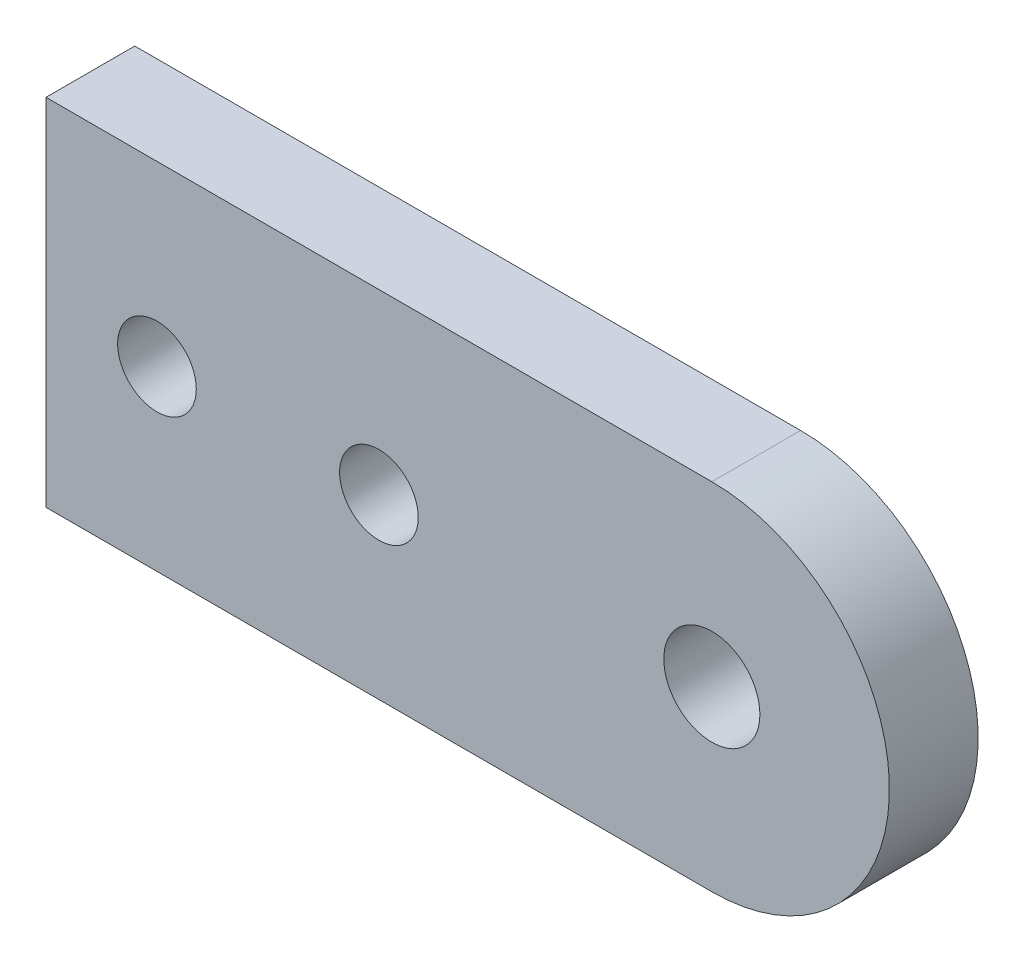
ISO-10303-21;
HEADER;
FILE_DESCRIPTION(('STEP AP214'),'2;1');
FILE_NAME('part.step','',(''),(''),'','','');
FILE_SCHEMA(('AUTOMOTIVE_DESIGN { 1 0 10303 214 1 1 1 1 }'));
ENDSEC;
DATA;
#1=APPLICATION_CONTEXT('core data for automotive mechanical design processes');
#2=APPLICATION_PROTOCOL_DEFINITION('international standard','automotive_design',2000,#1);
#3=PRODUCT_CONTEXT('',#1,'mechanical');
#4=PRODUCT('Part','Part','',(#3));
#5=PRODUCT_RELATED_PRODUCT_CATEGORY('part','',(#4));
#6=PRODUCT_DEFINITION_FORMATION('','',#4);
#7=PRODUCT_DEFINITION_CONTEXT('part definition',#1,'design');
#8=PRODUCT_DEFINITION('design','',#6,#7);
#9=PRODUCT_DEFINITION_SHAPE('','',#8);
#10=(LENGTH_UNIT() NAMED_UNIT(*) SI_UNIT(.MILLI.,.METRE.));
#11=(NAMED_UNIT(*) PLANE_ANGLE_UNIT() SI_UNIT($,.RADIAN.));
#12=(NAMED_UNIT(*) SI_UNIT($,.STERADIAN.) SOLID_ANGLE_UNIT());
#13=UNCERTAINTY_MEASURE_WITH_UNIT(LENGTH_MEASURE(1.E-05),#10,'distance_accuracy_value','');
#14=(GEOMETRIC_REPRESENTATION_CONTEXT(3) GLOBAL_UNCERTAINTY_ASSIGNED_CONTEXT((#13)) GLOBAL_UNIT_ASSIGNED_CONTEXT((#10,
#11,#12)) REPRESENTATION_CONTEXT('',''));
#15=CARTESIAN_POINT('',(0.,0.,0.));
#16=DIRECTION('',(0.,0.,1.));
#17=DIRECTION('',(1.,0.,0.));
#18=AXIS2_PLACEMENT_3D('',#15,#16,#17);
#19=CARTESIAN_POINT('',(38.1,10.16,5.08));
#20=DIRECTION('',(0.,-1.,0.));
#21=DIRECTION('',(1.,0.,0.));
#22=AXIS2_PLACEMENT_3D('',#19,#20,#21);
#23=PLANE('',#22);
#24=DIRECTION('',(-1.,0.,0.));
#25=VECTOR('',#24,1.);
#26=CARTESIAN_POINT('',(38.1,10.16,0.));
#27=LINE('',#26,#25);
#28=CARTESIAN_POINT('',(38.1,10.16,0.));
#29=VERTEX_POINT('',#28);
#30=CARTESIAN_POINT('',(0.,10.16,0.));
#31=VERTEX_POINT('',#30);
#32=EDGE_CURVE('E107',#29,#31,#27,.T.);
#33=ORIENTED_EDGE('',*,*,#32,.T.);
#34=DIRECTION('',(0.,0.,-1.));
#35=VECTOR('',#34,1.);
#36=CARTESIAN_POINT('',(0.,10.16,5.08));
#37=LINE('',#36,#35);
#38=CARTESIAN_POINT('',(0.,10.16,5.08));
#39=VERTEX_POINT('',#38);
#40=EDGE_CURVE('E11',#39,#31,#37,.T.);
#41=ORIENTED_EDGE('',*,*,#40,.F.);
#42=DIRECTION('',(-1.,0.,0.));
#43=VECTOR('',#42,1.);
#44=CARTESIAN_POINT('',(38.1,10.16,5.08));
#45=LINE('',#44,#43);
#46=CARTESIAN_POINT('',(38.1,10.16,5.08));
#47=VERTEX_POINT('',#46);
#48=EDGE_CURVE('E91',#47,#39,#45,.T.);
#49=ORIENTED_EDGE('',*,*,#48,.F.);
#50=DIRECTION('',(0.,0.,-1.));
#51=VECTOR('',#50,1.);
#52=CARTESIAN_POINT('',(38.1,10.16,5.08));
#53=LINE('',#52,#51);
#54=EDGE_CURVE('E103',#47,#29,#53,.T.);
#55=ORIENTED_EDGE('',*,*,#54,.T.);
#56=EDGE_LOOP('',(#33,#41,#49,#55));
#57=FACE_BOUND('',#56,.T.);
#58=ADVANCED_FACE('F39',(#57),#23,.F.);
#59=CARTESIAN_POINT('',(0.,10.16,5.08));
#60=DIRECTION('',(1.,0.,0.));
#61=DIRECTION('',(0.,1.,0.));
#62=AXIS2_PLACEMENT_3D('',#59,#60,#61);
#63=PLANE('',#62);
#64=DIRECTION('',(0.,-1.,0.));
#65=VECTOR('',#64,1.);
#66=CARTESIAN_POINT('',(0.,10.16,0.));
#67=LINE('',#66,#65);
#68=CARTESIAN_POINT('',(0.,-10.16,0.));
#69=VERTEX_POINT('',#68);
#70=EDGE_CURVE('E96',#31,#69,#67,.T.);
#71=ORIENTED_EDGE('',*,*,#70,.T.);
#72=DIRECTION('',(0.,0.,-1.));
#73=VECTOR('',#72,1.);
#74=CARTESIAN_POINT('',(0.,-10.16,5.08));
#75=LINE('',#74,#73);
#76=CARTESIAN_POINT('',(0.,-10.16,5.08));
#77=VERTEX_POINT('',#76);
#78=EDGE_CURVE('E48',#77,#69,#75,.T.);
#79=ORIENTED_EDGE('',*,*,#78,.F.);
#80=DIRECTION('',(0.,-1.,0.));
#81=VECTOR('',#80,1.);
#82=CARTESIAN_POINT('',(0.,10.16,5.08));
#83=LINE('',#82,#81);
#84=EDGE_CURVE('E86',#39,#77,#83,.T.);
#85=ORIENTED_EDGE('',*,*,#84,.F.);
#86=ORIENTED_EDGE('',*,*,#40,.T.);
#87=EDGE_LOOP('',(#71,#79,#85,#86));
#88=FACE_BOUND('',#87,.T.);
#89=ADVANCED_FACE('F95',(#88),#63,.F.);
#90=CARTESIAN_POINT('',(0.,-10.16,5.08));
#91=DIRECTION('',(0.,1.,0.));
#92=DIRECTION('',(-1.,0.,0.));
#93=AXIS2_PLACEMENT_3D('',#90,#91,#92);
#94=PLANE('',#93);
#95=DIRECTION('',(1.,0.,0.));
#96=VECTOR('',#95,1.);
#97=CARTESIAN_POINT('',(0.,-10.16,0.));
#98=LINE('',#97,#96);
#99=CARTESIAN_POINT('',(38.1,-10.16,0.));
#100=VERTEX_POINT('',#99);
#101=EDGE_CURVE('E73',#69,#100,#98,.T.);
#102=ORIENTED_EDGE('',*,*,#101,.T.);
#103=DIRECTION('',(0.,0.,-1.));
#104=VECTOR('',#103,1.);
#105=CARTESIAN_POINT('',(38.1,-10.16,5.08));
#106=LINE('',#105,#104);
#107=CARTESIAN_POINT('',(38.1,-10.16,5.08));
#108=VERTEX_POINT('',#107);
#109=EDGE_CURVE('E98',#108,#100,#106,.T.);
#110=ORIENTED_EDGE('',*,*,#109,.F.);
#111=DIRECTION('',(1.,0.,0.));
#112=VECTOR('',#111,1.);
#113=CARTESIAN_POINT('',(0.,-10.16,5.08));
#114=LINE('',#113,#112);
#115=EDGE_CURVE('E89',#77,#108,#114,.T.);
#116=ORIENTED_EDGE('',*,*,#115,.F.);
#117=ORIENTED_EDGE('',*,*,#78,.T.);
#118=EDGE_LOOP('',(#102,#110,#116,#117));
#119=FACE_BOUND('',#118,.T.);
#120=ADVANCED_FACE('F99',(#119),#94,.F.);
#121=CARTESIAN_POINT('',(38.1,0.,5.08));
#122=DIRECTION('',(0.,0.,-1.));
#123=DIRECTION('',(-1.,0.,0.));
#124=AXIS2_PLACEMENT_3D('',#121,#122,#123);
#125=CYLINDRICAL_SURFACE('',#124,10.16);
#126=CARTESIAN_POINT('',(38.1,0.,0.));
#127=DIRECTION('',(0.,0.,1.));
#128=DIRECTION('',(1.,0.,0.));
#129=AXIS2_PLACEMENT_3D('',#126,#127,#128);
#130=CIRCLE('',#129,10.16);
#131=EDGE_CURVE('E79',#100,#29,#130,.T.);
#132=ORIENTED_EDGE('',*,*,#131,.T.);
#133=ORIENTED_EDGE('',*,*,#54,.F.);
#134=CARTESIAN_POINT('',(38.1,0.,5.08));
#135=DIRECTION('',(0.,0.,1.));
#136=DIRECTION('',(1.,0.,0.));
#137=AXIS2_PLACEMENT_3D('',#134,#135,#136);
#138=CIRCLE('',#137,10.16);
#139=EDGE_CURVE('E56',#108,#47,#138,.T.);
#140=ORIENTED_EDGE('',*,*,#139,.F.);
#141=ORIENTED_EDGE('',*,*,#109,.T.);
#142=EDGE_LOOP('',(#132,#133,#140,#141));
#143=FACE_BOUND('',#142,.T.);
#144=ADVANCED_FACE('F121',(#143),#125,.T.);
#145=CARTESIAN_POINT('',(38.1,0.,5.08));
#146=DIRECTION('',(0.,0.,1.));
#147=DIRECTION('',(1.,0.,0.));
#148=AXIS2_PLACEMENT_3D('',#145,#146,#147);
#149=PLANE('',#148);
#150=CARTESIAN_POINT('',(19.0499944998667,-0.0163113571783296,5.08));
#151=DIRECTION('',(0.,0.,1.));
#152=DIRECTION('',(1.,0.,0.));
#153=AXIS2_PLACEMENT_3D('',#150,#151,#152);
#154=CIRCLE('',#153,2.25);
#155=CARTESIAN_POINT('',(21.2999944998667,-0.0163113571783296,5.08));
#156=VERTEX_POINT('',#155);
#157=EDGE_CURVE('E147',#156,#156,#154,.T.);
#158=ORIENTED_EDGE('',*,*,#157,.F.);
#159=EDGE_LOOP('',(#158));
#160=FACE_BOUND('',#159,.T.);
#161=CARTESIAN_POINT('',(6.35,-0.00449173977927071,5.08));
#162=DIRECTION('',(0.,0.,1.));
#163=DIRECTION('',(1.,0.,0.));
#164=AXIS2_PLACEMENT_3D('',#161,#162,#163);
#165=CIRCLE('',#164,2.24999999999999);
#166=CARTESIAN_POINT('',(8.59999999999999,-0.00449173977927071,5.08));
#167=VERTEX_POINT('',#166);
#168=EDGE_CURVE('E139',#167,#167,#165,.T.);
#169=ORIENTED_EDGE('',*,*,#168,.F.);
#170=EDGE_LOOP('',(#169));
#171=FACE_BOUND('',#170,.T.);
#172=CARTESIAN_POINT('',(38.1,0.,5.08));
#173=DIRECTION('',(0.,0.,1.));
#174=DIRECTION('',(1.,0.,0.));
#175=AXIS2_PLACEMENT_3D('',#172,#173,#174);
#176=CIRCLE('',#175,2.74999999999999);
#177=CARTESIAN_POINT('',(40.85,0.,5.08));
#178=VERTEX_POINT('',#177);
#179=EDGE_CURVE('E131',#178,#178,#176,.T.);
#180=ORIENTED_EDGE('',*,*,#179,.F.);
#181=EDGE_LOOP('',(#180));
#182=FACE_BOUND('',#181,.T.);
#183=ORIENTED_EDGE('',*,*,#48,.T.);
#184=ORIENTED_EDGE('',*,*,#84,.T.);
#185=ORIENTED_EDGE('',*,*,#115,.T.);
#186=ORIENTED_EDGE('',*,*,#139,.T.);
#187=EDGE_LOOP('',(#183,#184,#185,#186));
#188=FACE_BOUND('',#187,.T.);
#189=ADVANCED_FACE('F87',(#160,#171,#182,#188),#149,.T.);
#190=CARTESIAN_POINT('',(38.1,0.,0.));
#191=DIRECTION('',(0.,0.,1.));
#192=DIRECTION('',(1.,0.,0.));
#193=AXIS2_PLACEMENT_3D('',#190,#191,#192);
#194=PLANE('',#193);
#195=CARTESIAN_POINT('',(19.0499944998667,-0.0163113571783296,0.));
#196=DIRECTION('',(0.,0.,1.));
#197=DIRECTION('',(1.,0.,0.));
#198=AXIS2_PLACEMENT_3D('',#195,#196,#197);
#199=CIRCLE('',#198,2.25);
#200=CARTESIAN_POINT('',(21.2999944998667,-0.0163113571783296,0.));
#201=VERTEX_POINT('',#200);
#202=EDGE_CURVE('E143',#201,#201,#199,.T.);
#203=ORIENTED_EDGE('',*,*,#202,.T.);
#204=EDGE_LOOP('',(#203));
#205=FACE_BOUND('',#204,.T.);
#206=CARTESIAN_POINT('',(6.35,-0.00449173977927071,0.));
#207=DIRECTION('',(0.,0.,1.));
#208=DIRECTION('',(1.,0.,0.));
#209=AXIS2_PLACEMENT_3D('',#206,#207,#208);
#210=CIRCLE('',#209,2.24999999999999);
#211=CARTESIAN_POINT('',(8.59999999999999,-0.00449173977927071,0.));
#212=VERTEX_POINT('',#211);
#213=EDGE_CURVE('E135',#212,#212,#210,.T.);
#214=ORIENTED_EDGE('',*,*,#213,.T.);
#215=EDGE_LOOP('',(#214));
#216=FACE_BOUND('',#215,.T.);
#217=CARTESIAN_POINT('',(38.1,0.,0.));
#218=DIRECTION('',(0.,0.,1.));
#219=DIRECTION('',(1.,0.,0.));
#220=AXIS2_PLACEMENT_3D('',#217,#218,#219);
#221=CIRCLE('',#220,2.75);
#222=CARTESIAN_POINT('',(40.85,0.,0.));
#223=VERTEX_POINT('',#222);
#224=EDGE_CURVE('E111',#223,#223,#221,.T.);
#225=ORIENTED_EDGE('',*,*,#224,.T.);
#226=EDGE_LOOP('',(#225));
#227=FACE_BOUND('',#226,.T.);
#228=ORIENTED_EDGE('',*,*,#32,.F.);
#229=ORIENTED_EDGE('',*,*,#131,.F.);
#230=ORIENTED_EDGE('',*,*,#101,.F.);
#231=ORIENTED_EDGE('',*,*,#70,.F.);
#232=EDGE_LOOP('',(#228,#229,#230,#231));
#233=FACE_BOUND('',#232,.T.);
#234=ADVANCED_FACE('F124',(#205,#216,#227,#233),#194,.F.);
#235=CARTESIAN_POINT('',(38.1,0.,5.08));
#236=DIRECTION('',(0.,0.,1.));
#237=DIRECTION('',(1.,0.,0.));
#238=AXIS2_PLACEMENT_3D('',#235,#236,#237);
#239=CYLINDRICAL_SURFACE('',#238,2.74999999999999);
#240=ORIENTED_EDGE('',*,*,#224,.F.);
#241=EDGE_LOOP('',(#240));
#242=FACE_BOUND('',#241,.T.);
#243=ORIENTED_EDGE('',*,*,#179,.T.);
#244=EDGE_LOOP('',(#243));
#245=FACE_BOUND('',#244,.T.);
#246=ADVANCED_FACE('F161',(#242,#245),#239,.F.);
#247=CARTESIAN_POINT('',(6.35,-0.00449173977927071,5.08));
#248=DIRECTION('',(0.,0.,1.));
#249=DIRECTION('',(1.,0.,0.));
#250=AXIS2_PLACEMENT_3D('',#247,#248,#249);
#251=CYLINDRICAL_SURFACE('',#250,2.24999999999999);
#252=ORIENTED_EDGE('',*,*,#213,.F.);
#253=EDGE_LOOP('',(#252));
#254=FACE_BOUND('',#253,.T.);
#255=ORIENTED_EDGE('',*,*,#168,.T.);
#256=EDGE_LOOP('',(#255));
#257=FACE_BOUND('',#256,.T.);
#258=ADVANCED_FACE('F163',(#254,#257),#251,.F.);
#259=CARTESIAN_POINT('',(19.0499944998667,-0.0163113571783296,5.08));
#260=DIRECTION('',(0.,0.,1.));
#261=DIRECTION('',(1.,0.,0.));
#262=AXIS2_PLACEMENT_3D('',#259,#260,#261);
#263=CYLINDRICAL_SURFACE('',#262,2.25);
#264=ORIENTED_EDGE('',*,*,#202,.F.);
#265=EDGE_LOOP('',(#264));
#266=FACE_BOUND('',#265,.T.);
#267=ORIENTED_EDGE('',*,*,#157,.T.);
#268=EDGE_LOOP('',(#267));
#269=FACE_BOUND('',#268,.T.);
#270=ADVANCED_FACE('F152',(#266,#269),#263,.F.);
#271=CLOSED_SHELL('',(#58,#89,#120,#144,#189,#234,#246,#258,#270));
#272=MANIFOLD_SOLID_BREP('B2',#271);
#273=ADVANCED_BREP_SHAPE_REPRESENTATION('',(#18,#272),#14);
#274=SHAPE_DEFINITION_REPRESENTATION(#9,#273);
ENDSEC;
END-ISO-10303-21;
